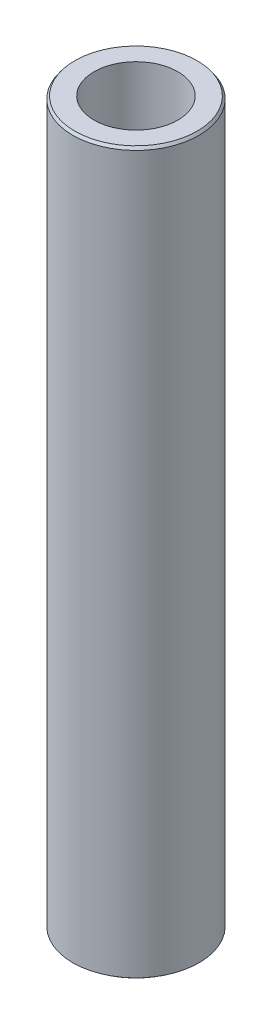
ISO-10303-21;
HEADER;
FILE_DESCRIPTION(('STEP AP214'),'2;1');
FILE_NAME('part.step','',(''),(''),'','','');
FILE_SCHEMA(('AUTOMOTIVE_DESIGN { 1 0 10303 214 1 1 1 1 }'));
ENDSEC;
DATA;
#1=APPLICATION_CONTEXT('core data for automotive mechanical design processes');
#2=APPLICATION_PROTOCOL_DEFINITION('international standard','automotive_design',2000,#1);
#3=PRODUCT_CONTEXT('',#1,'mechanical');
#4=PRODUCT('Part','Part','',(#3));
#5=PRODUCT_RELATED_PRODUCT_CATEGORY('part','',(#4));
#6=PRODUCT_DEFINITION_FORMATION('','',#4);
#7=PRODUCT_DEFINITION_CONTEXT('part definition',#1,'design');
#8=PRODUCT_DEFINITION('design','',#6,#7);
#9=PRODUCT_DEFINITION_SHAPE('','',#8);
#10=(LENGTH_UNIT() NAMED_UNIT(*) SI_UNIT(.MILLI.,.METRE.));
#11=(NAMED_UNIT(*) PLANE_ANGLE_UNIT() SI_UNIT($,.RADIAN.));
#12=(NAMED_UNIT(*) SI_UNIT($,.STERADIAN.) SOLID_ANGLE_UNIT());
#13=UNCERTAINTY_MEASURE_WITH_UNIT(LENGTH_MEASURE(1.E-05),#10,'distance_accuracy_value','');
#14=(GEOMETRIC_REPRESENTATION_CONTEXT(3) GLOBAL_UNCERTAINTY_ASSIGNED_CONTEXT((#13)) GLOBAL_UNIT_ASSIGNED_CONTEXT((#10,
#11,#12)) REPRESENTATION_CONTEXT('',''));
#15=CARTESIAN_POINT('',(0.,0.,0.));
#16=DIRECTION('',(0.,0.,1.));
#17=DIRECTION('',(1.,0.,0.));
#18=AXIS2_PLACEMENT_3D('',#15,#16,#17);
#19=CARTESIAN_POINT('',(0.,600.,0.));
#20=DIRECTION('',(0.,-1.,0.));
#21=DIRECTION('',(0.,0.,-1.));
#22=AXIS2_PLACEMENT_3D('',#19,#20,#21);
#23=CYLINDRICAL_SURFACE('',#22,52.5);
#24=CARTESIAN_POINT('',(0.,597.819791321491,0.));
#25=DIRECTION('',(0.,1.,0.));
#26=DIRECTION('',(0.,0.,1.));
#27=AXIS2_PLACEMENT_3D('',#24,#25,#26);
#28=CIRCLE('',#27,52.5);
#29=CARTESIAN_POINT('',(0.,597.819791321491,52.5));
#30=VERTEX_POINT('',#29);
#31=EDGE_CURVE('E50',#30,#30,#28,.F.);
#32=ORIENTED_EDGE('',*,*,#31,.T.);
#33=EDGE_LOOP('',(#32));
#34=FACE_BOUND('',#33,.T.);
#35=CARTESIAN_POINT('',(0.,1.63998576759294,0.));
#36=DIRECTION('',(0.,1.,0.));
#37=DIRECTION('',(0.,0.,1.));
#38=AXIS2_PLACEMENT_3D('',#35,#36,#37);
#39=CIRCLE('',#38,52.5);
#40=CARTESIAN_POINT('',(0.,1.63998576759294,52.5));
#41=VERTEX_POINT('',#40);
#42=EDGE_CURVE('E51',#41,#41,#39,.T.);
#43=ORIENTED_EDGE('',*,*,#42,.T.);
#44=EDGE_LOOP('',(#43));
#45=FACE_BOUND('',#44,.T.);
#46=ADVANCED_FACE('F39',(#34,#45),#23,.T.);
#47=CARTESIAN_POINT('',(0.,600.,0.));
#48=DIRECTION('',(0.,1.,0.));
#49=DIRECTION('',(0.,0.,1.));
#50=AXIS2_PLACEMENT_3D('',#47,#48,#49);
#51=PLANE('',#50);
#52=CARTESIAN_POINT('',(0.,600.,0.));
#53=DIRECTION('',(0.,1.,0.));
#54=DIRECTION('',(0.,0.,1.));
#55=AXIS2_PLACEMENT_3D('',#52,#53,#54);
#56=CIRCLE('',#55,50.8600142324071);
#57=CARTESIAN_POINT('',(0.,600.,50.8600142324071));
#58=VERTEX_POINT('',#57);
#59=EDGE_CURVE('E54',#58,#58,#56,.T.);
#60=ORIENTED_EDGE('',*,*,#59,.T.);
#61=EDGE_LOOP('',(#60));
#62=FACE_BOUND('',#61,.T.);
#63=CARTESIAN_POINT('',(0.,600.,0.));
#64=DIRECTION('',(0.,1.,0.));
#65=DIRECTION('',(0.,0.,1.));
#66=AXIS2_PLACEMENT_3D('',#63,#64,#65);
#67=CIRCLE('',#66,34.8872659247786);
#68=CARTESIAN_POINT('',(0.,600.,34.8872659247786));
#69=VERTEX_POINT('',#68);
#70=EDGE_CURVE('E58',#69,#69,#67,.T.);
#71=ORIENTED_EDGE('',*,*,#70,.F.);
#72=EDGE_LOOP('',(#71));
#73=FACE_BOUND('',#72,.T.);
#74=ADVANCED_FACE('F69',(#62,#73),#51,.T.);
#75=CARTESIAN_POINT('',(0.,0.,0.));
#76=DIRECTION('',(0.,1.,0.));
#77=DIRECTION('',(0.,0.,1.));
#78=AXIS2_PLACEMENT_3D('',#75,#76,#77);
#79=PLANE('',#78);
#80=CARTESIAN_POINT('',(0.,0.,0.));
#81=DIRECTION('',(0.,1.,0.));
#82=DIRECTION('',(0.,0.,1.));
#83=AXIS2_PLACEMENT_3D('',#80,#81,#82);
#84=CIRCLE('',#83,50.3197913214909);
#85=CARTESIAN_POINT('',(0.,0.,50.3197913214909));
#86=VERTEX_POINT('',#85);
#87=EDGE_CURVE('E10',#86,#86,#84,.F.);
#88=ORIENTED_EDGE('',*,*,#87,.T.);
#89=EDGE_LOOP('',(#88));
#90=FACE_BOUND('',#89,.T.);
#91=CARTESIAN_POINT('',(0.,0.,0.));
#92=DIRECTION('',(0.,1.,0.));
#93=DIRECTION('',(0.,0.,1.));
#94=AXIS2_PLACEMENT_3D('',#91,#92,#93);
#95=CIRCLE('',#94,34.8872659247786);
#96=CARTESIAN_POINT('',(0.,0.,34.8872659247786));
#97=VERTEX_POINT('',#96);
#98=EDGE_CURVE('E63',#97,#97,#95,.T.);
#99=ORIENTED_EDGE('',*,*,#98,.T.);
#100=EDGE_LOOP('',(#99));
#101=FACE_BOUND('',#100,.T.);
#102=ADVANCED_FACE('F75',(#90,#101),#79,.F.);
#103=CARTESIAN_POINT('',(0.,600.,0.));
#104=DIRECTION('',(0.,-1.,0.));
#105=DIRECTION('',(0.,0.,-1.));
#106=AXIS2_PLACEMENT_3D('',#103,#104,#105);
#107=CYLINDRICAL_SURFACE('',#106,34.8872659247786);
#108=ORIENTED_EDGE('',*,*,#70,.T.);
#109=EDGE_LOOP('',(#108));
#110=FACE_BOUND('',#109,.T.);
#111=ORIENTED_EDGE('',*,*,#98,.F.);
#112=EDGE_LOOP('',(#111));
#113=FACE_BOUND('',#112,.T.);
#114=ADVANCED_FACE('F70',(#110,#113),#107,.F.);
#115=CARTESIAN_POINT('',(0.,600.,0.));
#116=DIRECTION('',(0.,-1.,0.));
#117=DIRECTION('',(0.,0.,-1.));
#118=AXIS2_PLACEMENT_3D('',#115,#116,#117);
#119=CONICAL_SURFACE('',#118,50.8600142324071,0.644917230519027);
#120=ORIENTED_EDGE('',*,*,#31,.F.);
#121=EDGE_LOOP('',(#120));
#122=FACE_BOUND('',#121,.T.);
#123=ORIENTED_EDGE('',*,*,#59,.F.);
#124=EDGE_LOOP('',(#123));
#125=FACE_BOUND('',#124,.T.);
#126=ADVANCED_FACE('F81',(#122,#125),#119,.T.);
#127=CARTESIAN_POINT('',(0.,1.63998576759294,0.));
#128=DIRECTION('',(0.,1.,0.));
#129=DIRECTION('',(0.,0.,1.));
#130=AXIS2_PLACEMENT_3D('',#127,#128,#129);
#131=CONICAL_SURFACE('',#130,52.5,0.925879096275836);
#132=ORIENTED_EDGE('',*,*,#87,.F.);
#133=EDGE_LOOP('',(#132));
#134=FACE_BOUND('',#133,.T.);
#135=ORIENTED_EDGE('',*,*,#42,.F.);
#136=EDGE_LOOP('',(#135));
#137=FACE_BOUND('',#136,.T.);
#138=ADVANCED_FACE('F45',(#134,#137),#131,.T.);
#139=CLOSED_SHELL('',(#46,#74,#102,#114,#126,#138));
#140=MANIFOLD_SOLID_BREP('B2',#139);
#141=ADVANCED_BREP_SHAPE_REPRESENTATION('',(#18,#140),#14);
#142=SHAPE_DEFINITION_REPRESENTATION(#9,#141);
ENDSEC;
END-ISO-10303-21;
